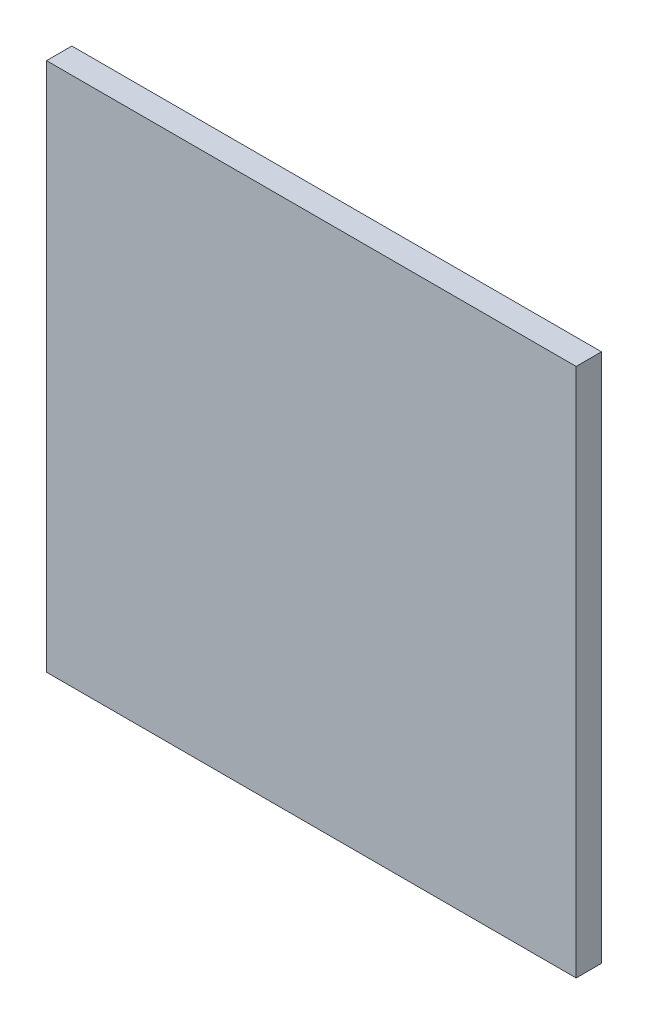
ISO-10303-21;
HEADER;
FILE_DESCRIPTION(('STEP AP214'),'2;1');
FILE_NAME('part.step','',(''),(''),'','','');
FILE_SCHEMA(('AUTOMOTIVE_DESIGN { 1 0 10303 214 1 1 1 1 }'));
ENDSEC;
DATA;
#1=APPLICATION_CONTEXT('core data for automotive mechanical design processes');
#2=APPLICATION_PROTOCOL_DEFINITION('international standard','automotive_design',2000,#1);
#3=PRODUCT_CONTEXT('',#1,'mechanical');
#4=PRODUCT('Part','Part','',(#3));
#5=PRODUCT_RELATED_PRODUCT_CATEGORY('part','',(#4));
#6=PRODUCT_DEFINITION_FORMATION('','',#4);
#7=PRODUCT_DEFINITION_CONTEXT('part definition',#1,'design');
#8=PRODUCT_DEFINITION('design','',#6,#7);
#9=PRODUCT_DEFINITION_SHAPE('','',#8);
#10=(LENGTH_UNIT() NAMED_UNIT(*) SI_UNIT(.MILLI.,.METRE.));
#11=(NAMED_UNIT(*) PLANE_ANGLE_UNIT() SI_UNIT($,.RADIAN.));
#12=(NAMED_UNIT(*) SI_UNIT($,.STERADIAN.) SOLID_ANGLE_UNIT());
#13=UNCERTAINTY_MEASURE_WITH_UNIT(LENGTH_MEASURE(1.E-05),#10,'distance_accuracy_value','');
#14=(GEOMETRIC_REPRESENTATION_CONTEXT(3) GLOBAL_UNCERTAINTY_ASSIGNED_CONTEXT((#13)) GLOBAL_UNIT_ASSIGNED_CONTEXT((#10,
#11,#12)) REPRESENTATION_CONTEXT('',''));
#15=CARTESIAN_POINT('',(0.,0.,0.));
#16=DIRECTION('',(0.,0.,1.));
#17=DIRECTION('',(1.,0.,0.));
#18=AXIS2_PLACEMENT_3D('',#15,#16,#17);
#19=CARTESIAN_POINT('',(0.,0.,0.1));
#20=DIRECTION('',(0.,0.,1.));
#21=DIRECTION('',(1.,0.,0.));
#22=AXIS2_PLACEMENT_3D('',#19,#20,#21);
#23=PLANE('',#22);
#24=DIRECTION('',(0.,1.,0.));
#25=VECTOR('',#24,1.);
#26=CARTESIAN_POINT('',(0.,0.,0.1));
#27=LINE('',#26,#25);
#28=CARTESIAN_POINT('',(0.,0.,0.1));
#29=VERTEX_POINT('',#28);
#30=CARTESIAN_POINT('',(0.,2.09,0.1));
#31=VERTEX_POINT('',#30);
#32=EDGE_CURVE('E72',#29,#31,#27,.T.);
#33=ORIENTED_EDGE('',*,*,#32,.F.);
#34=DIRECTION('',(1.,0.,0.));
#35=VECTOR('',#34,1.);
#36=CARTESIAN_POINT('',(0.,0.,0.1));
#37=LINE('',#36,#35);
#38=CARTESIAN_POINT('',(2.09,0.,0.1));
#39=VERTEX_POINT('',#38);
#40=EDGE_CURVE('E67',#29,#39,#37,.T.);
#41=ORIENTED_EDGE('',*,*,#40,.T.);
#42=DIRECTION('',(0.,1.,0.));
#43=VECTOR('',#42,1.);
#44=CARTESIAN_POINT('',(2.09,0.,0.1));
#45=LINE('',#44,#43);
#46=CARTESIAN_POINT('',(2.09,2.09,0.1));
#47=VERTEX_POINT('',#46);
#48=EDGE_CURVE('E69',#39,#47,#45,.T.);
#49=ORIENTED_EDGE('',*,*,#48,.T.);
#50=DIRECTION('',(1.,0.,0.));
#51=VECTOR('',#50,1.);
#52=CARTESIAN_POINT('',(0.,2.09,0.1));
#53=LINE('',#52,#51);
#54=EDGE_CURVE('E11',#31,#47,#53,.T.);
#55=ORIENTED_EDGE('',*,*,#54,.F.);
#56=EDGE_LOOP('',(#33,#41,#49,#55));
#57=FACE_BOUND('',#56,.T.);
#58=ADVANCED_FACE('F17',(#57),#23,.T.);
#59=CARTESIAN_POINT('',(0.,0.,0.));
#60=DIRECTION('',(0.,0.,1.));
#61=DIRECTION('',(1.,0.,0.));
#62=AXIS2_PLACEMENT_3D('',#59,#60,#61);
#63=PLANE('',#62);
#64=DIRECTION('',(1.,0.,0.));
#65=VECTOR('',#64,1.);
#66=CARTESIAN_POINT('',(0.,2.09,0.));
#67=LINE('',#66,#65);
#68=CARTESIAN_POINT('',(0.,2.09,0.));
#69=VERTEX_POINT('',#68);
#70=CARTESIAN_POINT('',(2.09,2.09,0.));
#71=VERTEX_POINT('',#70);
#72=EDGE_CURVE('E28',#69,#71,#67,.T.);
#73=ORIENTED_EDGE('',*,*,#72,.T.);
#74=DIRECTION('',(0.,1.,0.));
#75=VECTOR('',#74,1.);
#76=CARTESIAN_POINT('',(2.09,0.,0.));
#77=LINE('',#76,#75);
#78=CARTESIAN_POINT('',(2.09,0.,0.));
#79=VERTEX_POINT('',#78);
#80=EDGE_CURVE('E90',#79,#71,#77,.T.);
#81=ORIENTED_EDGE('',*,*,#80,.F.);
#82=DIRECTION('',(1.,0.,0.));
#83=VECTOR('',#82,1.);
#84=CARTESIAN_POINT('',(0.,0.,0.));
#85=LINE('',#84,#83);
#86=CARTESIAN_POINT('',(0.,0.,0.));
#87=VERTEX_POINT('',#86);
#88=EDGE_CURVE('E21',#87,#79,#85,.T.);
#89=ORIENTED_EDGE('',*,*,#88,.F.);
#90=DIRECTION('',(0.,1.,0.));
#91=VECTOR('',#90,1.);
#92=CARTESIAN_POINT('',(0.,0.,0.));
#93=LINE('',#92,#91);
#94=EDGE_CURVE('E99',#87,#69,#93,.T.);
#95=ORIENTED_EDGE('',*,*,#94,.T.);
#96=EDGE_LOOP('',(#73,#81,#89,#95));
#97=FACE_BOUND('',#96,.T.);
#98=ADVANCED_FACE('F19',(#97),#63,.F.);
#99=CARTESIAN_POINT('',(0.,2.09,0.));
#100=DIRECTION('',(0.,1.,0.));
#101=DIRECTION('',(1.,0.,0.));
#102=AXIS2_PLACEMENT_3D('',#99,#100,#101);
#103=PLANE('',#102);
#104=ORIENTED_EDGE('',*,*,#72,.F.);
#105=DIRECTION('',(0.,0.,1.));
#106=VECTOR('',#105,1.);
#107=CARTESIAN_POINT('',(0.,2.09,0.));
#108=LINE('',#107,#106);
#109=EDGE_CURVE('E106',#69,#31,#108,.T.);
#110=ORIENTED_EDGE('',*,*,#109,.T.);
#111=ORIENTED_EDGE('',*,*,#54,.T.);
#112=DIRECTION('',(0.,0.,1.));
#113=VECTOR('',#112,1.);
#114=CARTESIAN_POINT('',(2.09,2.09,0.));
#115=LINE('',#114,#113);
#116=EDGE_CURVE('E84',#71,#47,#115,.T.);
#117=ORIENTED_EDGE('',*,*,#116,.F.);
#118=EDGE_LOOP('',(#104,#110,#111,#117));
#119=FACE_BOUND('',#118,.T.);
#120=ADVANCED_FACE('F153',(#119),#103,.T.);
#121=CARTESIAN_POINT('',(0.,0.,0.));
#122=DIRECTION('',(0.,1.,0.));
#123=DIRECTION('',(1.,0.,0.));
#124=AXIS2_PLACEMENT_3D('',#121,#122,#123);
#125=PLANE('',#124);
#126=DIRECTION('',(0.,0.,1.));
#127=VECTOR('',#126,1.);
#128=CARTESIAN_POINT('',(2.09,0.,0.));
#129=LINE('',#128,#127);
#130=EDGE_CURVE('E83',#79,#39,#129,.T.);
#131=ORIENTED_EDGE('',*,*,#130,.T.);
#132=ORIENTED_EDGE('',*,*,#40,.F.);
#133=DIRECTION('',(0.,0.,1.));
#134=VECTOR('',#133,1.);
#135=CARTESIAN_POINT('',(0.,0.,0.));
#136=LINE('',#135,#134);
#137=EDGE_CURVE('E91',#87,#29,#136,.T.);
#138=ORIENTED_EDGE('',*,*,#137,.F.);
#139=ORIENTED_EDGE('',*,*,#88,.T.);
#140=EDGE_LOOP('',(#131,#132,#138,#139));
#141=FACE_BOUND('',#140,.T.);
#142=ADVANCED_FACE('F87',(#141),#125,.F.);
#143=CARTESIAN_POINT('',(2.09,0.,0.));
#144=DIRECTION('',(1.,0.,0.));
#145=DIRECTION('',(0.,1.,0.));
#146=AXIS2_PLACEMENT_3D('',#143,#144,#145);
#147=PLANE('',#146);
#148=ORIENTED_EDGE('',*,*,#130,.F.);
#149=ORIENTED_EDGE('',*,*,#80,.T.);
#150=ORIENTED_EDGE('',*,*,#116,.T.);
#151=ORIENTED_EDGE('',*,*,#48,.F.);
#152=EDGE_LOOP('',(#148,#149,#150,#151));
#153=FACE_BOUND('',#152,.T.);
#154=ADVANCED_FACE('F81',(#153),#147,.T.);
#155=CARTESIAN_POINT('',(0.,0.,0.));
#156=DIRECTION('',(1.,0.,0.));
#157=DIRECTION('',(0.,1.,0.));
#158=AXIS2_PLACEMENT_3D('',#155,#156,#157);
#159=PLANE('',#158);
#160=ORIENTED_EDGE('',*,*,#32,.T.);
#161=ORIENTED_EDGE('',*,*,#109,.F.);
#162=ORIENTED_EDGE('',*,*,#94,.F.);
#163=ORIENTED_EDGE('',*,*,#137,.T.);
#164=EDGE_LOOP('',(#160,#161,#162,#163));
#165=FACE_BOUND('',#164,.T.);
#166=ADVANCED_FACE('F156',(#165),#159,.F.);
#167=CLOSED_SHELL('',(#58,#98,#120,#142,#154,#166));
#168=MANIFOLD_SOLID_BREP('B1',#167);
#169=ADVANCED_BREP_SHAPE_REPRESENTATION('',(#18,#168),#14);
#170=SHAPE_DEFINITION_REPRESENTATION(#9,#169);
ENDSEC;
END-ISO-10303-21;
